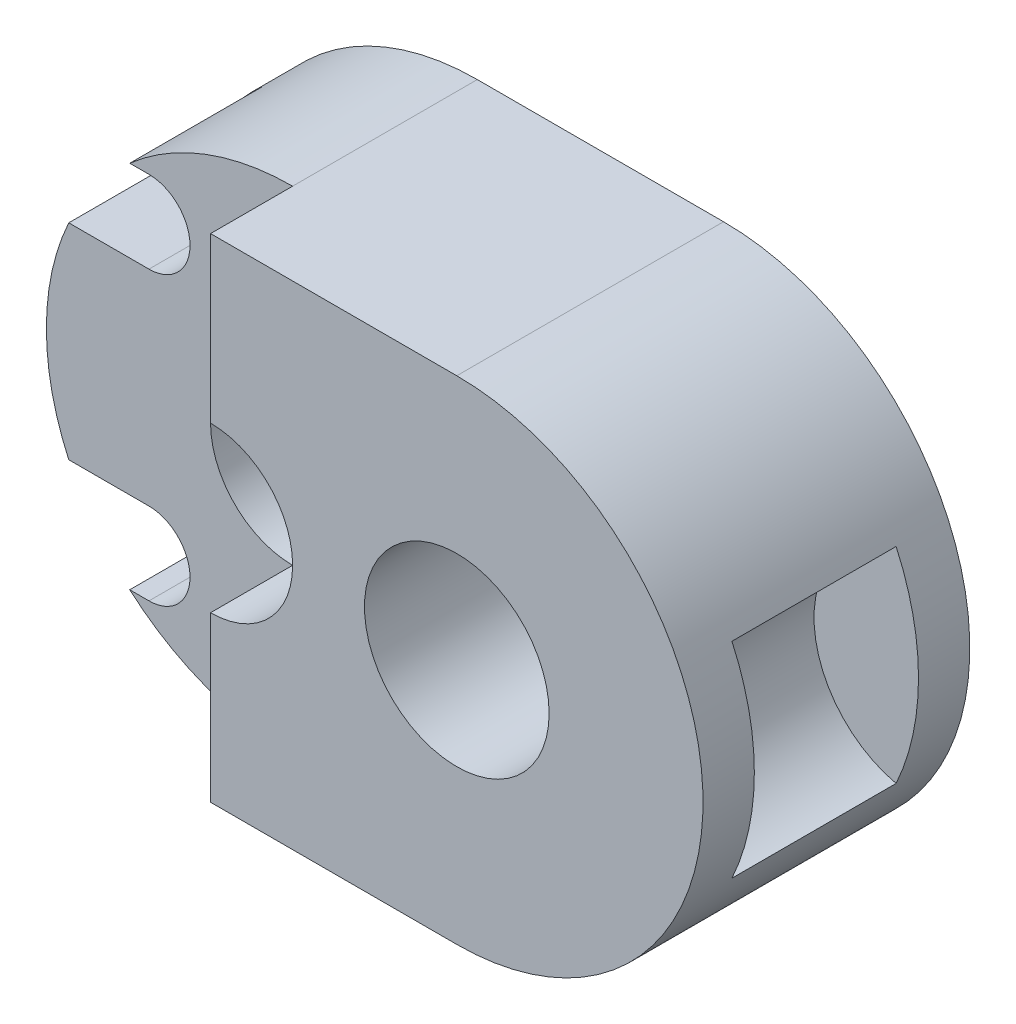
ISO-10303-21;
HEADER;
FILE_DESCRIPTION(('STEP AP214'),'2;1');
FILE_NAME('part.step','',(''),(''),'','','');
FILE_SCHEMA(('AUTOMOTIVE_DESIGN { 1 0 10303 214 1 1 1 1 }'));
ENDSEC;
DATA;
#1=APPLICATION_CONTEXT('core data for automotive mechanical design processes');
#2=APPLICATION_PROTOCOL_DEFINITION('international standard','automotive_design',2000,#1);
#3=PRODUCT_CONTEXT('',#1,'mechanical');
#4=PRODUCT('Part','Part','',(#3));
#5=PRODUCT_RELATED_PRODUCT_CATEGORY('part','',(#4));
#6=PRODUCT_DEFINITION_FORMATION('','',#4);
#7=PRODUCT_DEFINITION_CONTEXT('part definition',#1,'design');
#8=PRODUCT_DEFINITION('design','',#6,#7);
#9=PRODUCT_DEFINITION_SHAPE('','',#8);
#10=(LENGTH_UNIT() NAMED_UNIT(*) SI_UNIT(.MILLI.,.METRE.));
#11=(NAMED_UNIT(*) PLANE_ANGLE_UNIT() SI_UNIT($,.RADIAN.));
#12=(NAMED_UNIT(*) SI_UNIT($,.STERADIAN.) SOLID_ANGLE_UNIT());
#13=UNCERTAINTY_MEASURE_WITH_UNIT(LENGTH_MEASURE(1.E-05),#10,'distance_accuracy_value','');
#14=(GEOMETRIC_REPRESENTATION_CONTEXT(3) GLOBAL_UNCERTAINTY_ASSIGNED_CONTEXT((#13)) GLOBAL_UNIT_ASSIGNED_CONTEXT((#10,
#11,#12)) REPRESENTATION_CONTEXT('',''));
#15=CARTESIAN_POINT('',(0.,0.,0.));
#16=DIRECTION('',(0.,0.,1.));
#17=DIRECTION('',(1.,0.,0.));
#18=AXIS2_PLACEMENT_3D('',#15,#16,#17);
#19=CARTESIAN_POINT('',(-3.,0.,3.25));
#20=DIRECTION('',(0.,0.,-1.));
#21=DIRECTION('',(-1.,0.,0.));
#22=AXIS2_PLACEMENT_3D('',#19,#20,#21);
#23=CYLINDRICAL_SURFACE('',#22,0.5);
#24=CARTESIAN_POINT('',(-3.,0.,-3.25));
#25=DIRECTION('',(0.,0.,1.));
#26=DIRECTION('',(1.,0.,0.));
#27=AXIS2_PLACEMENT_3D('',#24,#25,#26);
#28=CIRCLE('',#27,0.5);
#29=CARTESIAN_POINT('',(-2.5,0.,-3.25));
#30=VERTEX_POINT('',#29);
#31=EDGE_CURVE('E290',#30,#30,#28,.T.);
#32=ORIENTED_EDGE('',*,*,#31,.F.);
#33=EDGE_LOOP('',(#32));
#34=FACE_BOUND('',#33,.T.);
#35=CARTESIAN_POINT('',(-3.,0.,-0.25));
#36=DIRECTION('',(0.,0.,1.));
#37=DIRECTION('',(1.,0.,0.));
#38=AXIS2_PLACEMENT_3D('',#35,#36,#37);
#39=CIRCLE('',#38,0.5);
#40=CARTESIAN_POINT('',(-2.5,0.,-0.25));
#41=VERTEX_POINT('',#40);
#42=EDGE_CURVE('E262',#41,#41,#39,.T.);
#43=ORIENTED_EDGE('',*,*,#42,.T.);
#44=EDGE_LOOP('',(#43));
#45=FACE_BOUND('',#44,.T.);
#46=ADVANCED_FACE('F68',(#34,#45),#23,.F.);
#47=CARTESIAN_POINT('',(-3.,0.,3.25));
#48=DIRECTION('',(0.,0.,1.));
#49=DIRECTION('',(1.,0.,0.));
#50=AXIS2_PLACEMENT_3D('',#47,#48,#49);
#51=PLANE('',#50);
#52=CARTESIAN_POINT('',(3.,0.,3.25));
#53=DIRECTION('',(0.,0.,1.));
#54=DIRECTION('',(1.,0.,0.));
#55=AXIS2_PLACEMENT_3D('',#52,#53,#54);
#56=CIRCLE('',#55,2.25);
#57=CARTESIAN_POINT('',(5.25,0.,3.25));
#58=VERTEX_POINT('',#57);
#59=EDGE_CURVE('E245',#58,#58,#56,.T.);
#60=ORIENTED_EDGE('',*,*,#59,.F.);
#61=EDGE_LOOP('',(#60));
#62=FACE_BOUND('',#61,.T.);
#63=CARTESIAN_POINT('',(-3.,0.,3.25));
#64=DIRECTION('',(0.,0.,1.));
#65=DIRECTION('',(1.,0.,0.));
#66=AXIS2_PLACEMENT_3D('',#63,#64,#65);
#67=CIRCLE('',#66,2.);
#68=CARTESIAN_POINT('',(-3.,-2.,3.25));
#69=VERTEX_POINT('',#68);
#70=CARTESIAN_POINT('',(-3.,2.,3.25));
#71=VERTEX_POINT('',#70);
#72=EDGE_CURVE('E249',#69,#71,#67,.T.);
#73=ORIENTED_EDGE('',*,*,#72,.F.);
#74=DIRECTION('',(0.,1.,0.));
#75=VECTOR('',#74,1.);
#76=CARTESIAN_POINT('',(-3.,6.,3.25));
#77=LINE('',#76,#75);
#78=CARTESIAN_POINT('',(-3.,-6.,3.25));
#79=VERTEX_POINT('',#78);
#80=EDGE_CURVE('E267',#79,#69,#77,.T.);
#81=ORIENTED_EDGE('',*,*,#80,.F.);
#82=DIRECTION('',(1.,0.,0.));
#83=VECTOR('',#82,1.);
#84=CARTESIAN_POINT('',(-3.,-6.,3.25));
#85=LINE('',#84,#83);
#86=CARTESIAN_POINT('',(3.,-6.,3.25));
#87=VERTEX_POINT('',#86);
#88=EDGE_CURVE('E296',#79,#87,#85,.T.);
#89=ORIENTED_EDGE('',*,*,#88,.T.);
#90=CARTESIAN_POINT('',(3.,0.,3.25));
#91=DIRECTION('',(0.,0.,1.));
#92=DIRECTION('',(1.,0.,0.));
#93=AXIS2_PLACEMENT_3D('',#90,#91,#92);
#94=CIRCLE('',#93,6.);
#95=CARTESIAN_POINT('',(3.,6.,3.25));
#96=VERTEX_POINT('',#95);
#97=EDGE_CURVE('E298',#87,#96,#94,.T.);
#98=ORIENTED_EDGE('',*,*,#97,.T.);
#99=DIRECTION('',(-1.,0.,0.));
#100=VECTOR('',#99,1.);
#101=CARTESIAN_POINT('',(-3.,6.,3.25));
#102=LINE('',#101,#100);
#103=CARTESIAN_POINT('',(-3.,6.,3.25));
#104=VERTEX_POINT('',#103);
#105=EDGE_CURVE('E301',#96,#104,#102,.T.);
#106=ORIENTED_EDGE('',*,*,#105,.T.);
#107=EDGE_CURVE('E268',#71,#104,#77,.T.);
#108=ORIENTED_EDGE('',*,*,#107,.F.);
#109=EDGE_LOOP('',(#73,#81,#89,#98,#106,#108));
#110=FACE_BOUND('',#109,.T.);
#111=ADVANCED_FACE('F389',(#62,#110),#51,.T.);
#112=CARTESIAN_POINT('',(-3.,0.,-3.25));
#113=DIRECTION('',(0.,0.,1.));
#114=DIRECTION('',(1.,0.,0.));
#115=AXIS2_PLACEMENT_3D('',#112,#113,#114);
#116=PLANE('',#115);
#117=CARTESIAN_POINT('',(3.,0.,-3.25));
#118=DIRECTION('',(0.,0.,1.));
#119=DIRECTION('',(1.,0.,0.));
#120=AXIS2_PLACEMENT_3D('',#117,#118,#119);
#121=CIRCLE('',#120,0.474999999999998);
#122=CARTESIAN_POINT('',(3.475,0.,-3.25));
#123=VERTEX_POINT('',#122);
#124=EDGE_CURVE('E366',#123,#123,#121,.T.);
#125=ORIENTED_EDGE('',*,*,#124,.T.);
#126=EDGE_LOOP('',(#125));
#127=FACE_BOUND('',#126,.T.);
#128=CARTESIAN_POINT('',(-6.5,3.5,-3.25));
#129=DIRECTION('',(0.,0.,1.));
#130=DIRECTION('',(1.,0.,0.));
#131=AXIS2_PLACEMENT_3D('',#128,#129,#130);
#132=CIRCLE('',#131,0.474999999999998);
#133=CARTESIAN_POINT('',(-6.025,3.5,-3.25));
#134=VERTEX_POINT('',#133);
#135=EDGE_CURVE('E360',#134,#134,#132,.T.);
#136=ORIENTED_EDGE('',*,*,#135,.T.);
#137=EDGE_LOOP('',(#136));
#138=FACE_BOUND('',#137,.T.);
#139=CARTESIAN_POINT('',(-6.5,-3.5,-3.25));
#140=DIRECTION('',(0.,0.,1.));
#141=DIRECTION('',(1.,0.,0.));
#142=AXIS2_PLACEMENT_3D('',#139,#140,#141);
#143=CIRCLE('',#142,0.474999999999998);
#144=CARTESIAN_POINT('',(-6.025,-3.5,-3.25));
#145=VERTEX_POINT('',#144);
#146=EDGE_CURVE('E72',#145,#145,#143,.T.);
#147=ORIENTED_EDGE('',*,*,#146,.T.);
#148=EDGE_LOOP('',(#147));
#149=FACE_BOUND('',#148,.T.);
#150=CARTESIAN_POINT('',(-3.,0.,-3.25));
#151=DIRECTION('',(0.,0.,1.));
#152=DIRECTION('',(1.,0.,0.));
#153=AXIS2_PLACEMENT_3D('',#150,#151,#152);
#154=CIRCLE('',#153,6.);
#155=CARTESIAN_POINT('',(-3.,6.,-3.25));
#156=VERTEX_POINT('',#155);
#157=CARTESIAN_POINT('',(-3.,-6.,-3.25));
#158=VERTEX_POINT('',#157);
#159=EDGE_CURVE('E295',#156,#158,#154,.T.);
#160=ORIENTED_EDGE('',*,*,#159,.F.);
#161=DIRECTION('',(-1.,0.,0.));
#162=VECTOR('',#161,1.);
#163=CARTESIAN_POINT('',(-3.,6.,-3.25));
#164=LINE('',#163,#162);
#165=CARTESIAN_POINT('',(3.,6.,-3.25));
#166=VERTEX_POINT('',#165);
#167=EDGE_CURVE('E299',#166,#156,#164,.T.);
#168=ORIENTED_EDGE('',*,*,#167,.F.);
#169=CARTESIAN_POINT('',(3.,0.,-3.25));
#170=DIRECTION('',(0.,0.,1.));
#171=DIRECTION('',(1.,0.,0.));
#172=AXIS2_PLACEMENT_3D('',#169,#170,#171);
#173=CIRCLE('',#172,6.);
#174=CARTESIAN_POINT('',(3.,-6.,-3.25));
#175=VERTEX_POINT('',#174);
#176=EDGE_CURVE('E309',#175,#166,#173,.T.);
#177=ORIENTED_EDGE('',*,*,#176,.F.);
#178=DIRECTION('',(1.,0.,0.));
#179=VECTOR('',#178,1.);
#180=CARTESIAN_POINT('',(-3.,-6.,-3.25));
#181=LINE('',#180,#179);
#182=EDGE_CURVE('E307',#158,#175,#181,.T.);
#183=ORIENTED_EDGE('',*,*,#182,.F.);
#184=EDGE_LOOP('',(#160,#168,#177,#183));
#185=FACE_BOUND('',#184,.T.);
#186=ORIENTED_EDGE('',*,*,#31,.T.);
#187=EDGE_LOOP('',(#186));
#188=FACE_BOUND('',#187,.T.);
#189=ADVANCED_FACE('F392',(#127,#138,#149,#185,#188),#116,.F.);
#190=CARTESIAN_POINT('',(-3.,0.,3.25));
#191=DIRECTION('',(0.,0.,-1.));
#192=DIRECTION('',(-1.,0.,0.));
#193=AXIS2_PLACEMENT_3D('',#190,#191,#192);
#194=CYLINDRICAL_SURFACE('',#193,6.);
#195=CARTESIAN_POINT('',(-3.,0.,-2.));
#196=DIRECTION('',(0.,0.,1.));
#197=DIRECTION('',(1.,0.,0.));
#198=AXIS2_PLACEMENT_3D('',#195,#196,#197);
#199=CIRCLE('',#198,6.);
#200=CARTESIAN_POINT('',(-6.96862696659689,4.5,-2.));
#201=VERTEX_POINT('',#200);
#202=CARTESIAN_POINT('',(-8.45435605731786,2.5,-2.));
#203=VERTEX_POINT('',#202);
#204=EDGE_CURVE('E12',#201,#203,#199,.T.);
#205=ORIENTED_EDGE('',*,*,#204,.F.);
#206=DIRECTION('',(0.,0.,-1.));
#207=VECTOR('',#206,1.);
#208=CARTESIAN_POINT('',(-6.96862696659689,4.5,3.25));
#209=LINE('',#208,#207);
#210=CARTESIAN_POINT('',(-6.96862696659689,4.5,1.25));
#211=VERTEX_POINT('',#210);
#212=EDGE_CURVE('E242',#201,#211,#209,.F.);
#213=ORIENTED_EDGE('',*,*,#212,.T.);
#214=CARTESIAN_POINT('',(-3.,0.,1.25));
#215=DIRECTION('',(0.,0.,-1.));
#216=DIRECTION('',(-1.,0.,0.));
#217=AXIS2_PLACEMENT_3D('',#214,#215,#216);
#218=CIRCLE('',#217,6.);
#219=CARTESIAN_POINT('',(-3.,6.,1.25));
#220=VERTEX_POINT('',#219);
#221=EDGE_CURVE('E275',#211,#220,#218,.T.);
#222=ORIENTED_EDGE('',*,*,#221,.T.);
#223=DIRECTION('',(0.,0.,-1.));
#224=VECTOR('',#223,1.);
#225=CARTESIAN_POINT('',(-3.,6.,3.25));
#226=LINE('',#225,#224);
#227=EDGE_CURVE('E304',#220,#156,#226,.T.);
#228=ORIENTED_EDGE('',*,*,#227,.T.);
#229=ORIENTED_EDGE('',*,*,#159,.T.);
#230=DIRECTION('',(0.,0.,-1.));
#231=VECTOR('',#230,1.);
#232=CARTESIAN_POINT('',(-3.,-6.,3.25));
#233=LINE('',#232,#231);
#234=CARTESIAN_POINT('',(-3.,-6.,1.25));
#235=VERTEX_POINT('',#234);
#236=EDGE_CURVE('E322',#235,#158,#233,.T.);
#237=ORIENTED_EDGE('',*,*,#236,.F.);
#238=CARTESIAN_POINT('',(-6.96862696659688,-4.5,1.25));
#239=VERTEX_POINT('',#238);
#240=EDGE_CURVE('E270',#235,#239,#218,.T.);
#241=ORIENTED_EDGE('',*,*,#240,.T.);
#242=DIRECTION('',(0.,0.,-1.));
#243=VECTOR('',#242,1.);
#244=CARTESIAN_POINT('',(-6.96862696659689,-4.5,3.25));
#245=LINE('',#244,#243);
#246=CARTESIAN_POINT('',(-6.96862696659688,-4.5,-2.));
#247=VERTEX_POINT('',#246);
#248=EDGE_CURVE('E217',#247,#239,#245,.F.);
#249=ORIENTED_EDGE('',*,*,#248,.F.);
#250=CARTESIAN_POINT('',(-3.,0.,-2.));
#251=DIRECTION('',(0.,0.,1.));
#252=DIRECTION('',(1.,0.,0.));
#253=AXIS2_PLACEMENT_3D('',#250,#251,#252);
#254=CIRCLE('',#253,6.);
#255=CARTESIAN_POINT('',(-8.45435605731786,-2.5,-2.));
#256=VERTEX_POINT('',#255);
#257=EDGE_CURVE('E77',#256,#247,#254,.T.);
#258=ORIENTED_EDGE('',*,*,#257,.F.);
#259=DIRECTION('',(0.,0.,-1.));
#260=VECTOR('',#259,1.);
#261=CARTESIAN_POINT('',(-8.45435605731786,-2.5,3.25));
#262=LINE('',#261,#260);
#263=CARTESIAN_POINT('',(-8.45435605731786,-2.5,1.25));
#264=VERTEX_POINT('',#263);
#265=EDGE_CURVE('E238',#256,#264,#262,.F.);
#266=ORIENTED_EDGE('',*,*,#265,.T.);
#267=CARTESIAN_POINT('',(-8.45435605731786,2.5,1.25));
#268=VERTEX_POINT('',#267);
#269=EDGE_CURVE('E274',#264,#268,#218,.T.);
#270=ORIENTED_EDGE('',*,*,#269,.T.);
#271=DIRECTION('',(0.,0.,-1.));
#272=VECTOR('',#271,1.);
#273=CARTESIAN_POINT('',(-8.45435605731786,2.5,3.25));
#274=LINE('',#273,#272);
#275=EDGE_CURVE('E92',#203,#268,#274,.F.);
#276=ORIENTED_EDGE('',*,*,#275,.F.);
#277=EDGE_LOOP('',(#205,#213,#222,#228,#229,#237,#241,#249,#258,#266,#270,#276));
#278=FACE_BOUND('',#277,.T.);
#279=ADVANCED_FACE('F70',(#278),#194,.T.);
#280=CARTESIAN_POINT('',(-3.,-6.,3.25));
#281=DIRECTION('',(0.,1.,0.));
#282=DIRECTION('',(-1.,0.,0.));
#283=AXIS2_PLACEMENT_3D('',#280,#281,#282);
#284=PLANE('',#283);
#285=ORIENTED_EDGE('',*,*,#182,.T.);
#286=DIRECTION('',(0.,0.,-1.));
#287=VECTOR('',#286,1.);
#288=CARTESIAN_POINT('',(3.,-6.,3.25));
#289=LINE('',#288,#287);
#290=EDGE_CURVE('E319',#87,#175,#289,.T.);
#291=ORIENTED_EDGE('',*,*,#290,.F.);
#292=ORIENTED_EDGE('',*,*,#88,.F.);
#293=EDGE_CURVE('E323',#79,#235,#233,.T.);
#294=ORIENTED_EDGE('',*,*,#293,.T.);
#295=ORIENTED_EDGE('',*,*,#236,.T.);
#296=EDGE_LOOP('',(#285,#291,#292,#294,#295));
#297=FACE_BOUND('',#296,.T.);
#298=ADVANCED_FACE('F415',(#297),#284,.F.);
#299=CARTESIAN_POINT('',(3.,0.,3.25));
#300=DIRECTION('',(0.,0.,-1.));
#301=DIRECTION('',(-1.,0.,0.));
#302=AXIS2_PLACEMENT_3D('',#299,#300,#301);
#303=CYLINDRICAL_SURFACE('',#302,6.);
#304=DIRECTION('',(0.,0.,1.));
#305=VECTOR('',#304,1.);
#306=CARTESIAN_POINT('',(8.45435605731786,2.5,-2.));
#307=LINE('',#306,#305);
#308=CARTESIAN_POINT('',(8.45435605731786,2.5,-2.));
#309=VERTEX_POINT('',#308);
#310=CARTESIAN_POINT('',(8.45435605731786,2.5,2.));
#311=VERTEX_POINT('',#310);
#312=EDGE_CURVE('E282',#309,#311,#307,.T.);
#313=ORIENTED_EDGE('',*,*,#312,.F.);
#314=CARTESIAN_POINT('',(3.,0.,-2.));
#315=DIRECTION('',(0.,0.,1.));
#316=DIRECTION('',(-1.,0.,0.));
#317=AXIS2_PLACEMENT_3D('',#314,#315,#316);
#318=CIRCLE('',#317,6.);
#319=CARTESIAN_POINT('',(8.45435605731785,-2.5,-2.));
#320=VERTEX_POINT('',#319);
#321=EDGE_CURVE('E276',#320,#309,#318,.T.);
#322=ORIENTED_EDGE('',*,*,#321,.F.);
#323=DIRECTION('',(0.,0.,1.));
#324=VECTOR('',#323,1.);
#325=CARTESIAN_POINT('',(8.45435605731785,-2.5,-2.));
#326=LINE('',#325,#324);
#327=CARTESIAN_POINT('',(8.45435605731785,-2.5,2.));
#328=VERTEX_POINT('',#327);
#329=EDGE_CURVE('E287',#320,#328,#326,.T.);
#330=ORIENTED_EDGE('',*,*,#329,.T.);
#331=CARTESIAN_POINT('',(3.,0.,2.));
#332=DIRECTION('',(0.,0.,1.));
#333=DIRECTION('',(-1.,0.,0.));
#334=AXIS2_PLACEMENT_3D('',#331,#332,#333);
#335=CIRCLE('',#334,6.);
#336=EDGE_CURVE('E273',#328,#311,#335,.T.);
#337=ORIENTED_EDGE('',*,*,#336,.T.);
#338=EDGE_LOOP('',(#313,#322,#330,#337));
#339=FACE_BOUND('',#338,.T.);
#340=ORIENTED_EDGE('',*,*,#176,.T.);
#341=DIRECTION('',(0.,0.,-1.));
#342=VECTOR('',#341,1.);
#343=CARTESIAN_POINT('',(3.,6.,3.25));
#344=LINE('',#343,#342);
#345=EDGE_CURVE('E316',#96,#166,#344,.T.);
#346=ORIENTED_EDGE('',*,*,#345,.F.);
#347=ORIENTED_EDGE('',*,*,#97,.F.);
#348=ORIENTED_EDGE('',*,*,#290,.T.);
#349=EDGE_LOOP('',(#340,#346,#347,#348));
#350=FACE_BOUND('',#349,.T.);
#351=ADVANCED_FACE('F418',(#339,#350),#303,.T.);
#352=CARTESIAN_POINT('',(-3.,6.,3.25));
#353=DIRECTION('',(0.,-1.,0.));
#354=DIRECTION('',(1.,0.,0.));
#355=AXIS2_PLACEMENT_3D('',#352,#353,#354);
#356=PLANE('',#355);
#357=ORIENTED_EDGE('',*,*,#167,.T.);
#358=ORIENTED_EDGE('',*,*,#227,.F.);
#359=EDGE_CURVE('E313',#104,#220,#226,.T.);
#360=ORIENTED_EDGE('',*,*,#359,.F.);
#361=ORIENTED_EDGE('',*,*,#105,.F.);
#362=ORIENTED_EDGE('',*,*,#345,.T.);
#363=EDGE_LOOP('',(#357,#358,#360,#361,#362));
#364=FACE_BOUND('',#363,.T.);
#365=ADVANCED_FACE('F406',(#364),#356,.F.);
#366=CARTESIAN_POINT('',(9.01685605731786,0.,-2.));
#367=DIRECTION('',(0.,0.,1.));
#368=DIRECTION('',(1.,0.,0.));
#369=AXIS2_PLACEMENT_3D('',#366,#367,#368);
#370=CYLINDRICAL_SURFACE('',#369,2.5625);
#371=CARTESIAN_POINT('',(9.01685605731786,0.,2.));
#372=DIRECTION('',(0.,0.,1.));
#373=DIRECTION('',(1.,0.,0.));
#374=AXIS2_PLACEMENT_3D('',#371,#372,#373);
#375=CIRCLE('',#374,2.5625);
#376=EDGE_CURVE('E279',#311,#328,#375,.T.);
#377=ORIENTED_EDGE('',*,*,#376,.T.);
#378=ORIENTED_EDGE('',*,*,#329,.F.);
#379=CARTESIAN_POINT('',(9.01685605731786,0.,-2.));
#380=DIRECTION('',(0.,0.,1.));
#381=DIRECTION('',(1.,0.,0.));
#382=AXIS2_PLACEMENT_3D('',#379,#380,#381);
#383=CIRCLE('',#382,2.5625);
#384=EDGE_CURVE('E278',#309,#320,#383,.T.);
#385=ORIENTED_EDGE('',*,*,#384,.F.);
#386=ORIENTED_EDGE('',*,*,#312,.T.);
#387=EDGE_LOOP('',(#377,#378,#385,#386));
#388=FACE_BOUND('',#387,.T.);
#389=ADVANCED_FACE('F427',(#388),#370,.F.);
#390=CARTESIAN_POINT('',(6.00842802865893,0.,-2.));
#391=DIRECTION('',(0.,0.,-1.));
#392=DIRECTION('',(-1.,0.,0.));
#393=AXIS2_PLACEMENT_3D('',#390,#391,#392);
#394=PLANE('',#393);
#395=ORIENTED_EDGE('',*,*,#321,.T.);
#396=ORIENTED_EDGE('',*,*,#384,.T.);
#397=EDGE_LOOP('',(#395,#396));
#398=FACE_BOUND('',#397,.T.);
#399=ADVANCED_FACE('F500',(#398),#394,.F.);
#400=CARTESIAN_POINT('',(6.00842802865893,0.,2.));
#401=DIRECTION('',(0.,0.,-1.));
#402=DIRECTION('',(-1.,0.,0.));
#403=AXIS2_PLACEMENT_3D('',#400,#401,#402);
#404=PLANE('',#403);
#405=ORIENTED_EDGE('',*,*,#336,.F.);
#406=ORIENTED_EDGE('',*,*,#376,.F.);
#407=EDGE_LOOP('',(#405,#406));
#408=FACE_BOUND('',#407,.T.);
#409=ADVANCED_FACE('F502',(#408),#404,.T.);
#410=CARTESIAN_POINT('',(-3.,6.,1.25));
#411=DIRECTION('',(1.,0.,0.));
#412=DIRECTION('',(0.,0.,-1.));
#413=AXIS2_PLACEMENT_3D('',#410,#411,#412);
#414=PLANE('',#413);
#415=ORIENTED_EDGE('',*,*,#80,.T.);
#416=DIRECTION('',(0.,0.,1.));
#417=VECTOR('',#416,1.);
#418=CARTESIAN_POINT('',(-3.,-2.,-0.25));
#419=LINE('',#418,#417);
#420=CARTESIAN_POINT('',(-3.,-2.,1.25));
#421=VERTEX_POINT('',#420);
#422=EDGE_CURVE('E259',#69,#421,#419,.F.);
#423=ORIENTED_EDGE('',*,*,#422,.T.);
#424=DIRECTION('',(0.,1.,0.));
#425=VECTOR('',#424,1.);
#426=CARTESIAN_POINT('',(-3.,6.,1.25));
#427=LINE('',#426,#425);
#428=EDGE_CURVE('E266',#235,#421,#427,.T.);
#429=ORIENTED_EDGE('',*,*,#428,.F.);
#430=ORIENTED_EDGE('',*,*,#293,.F.);
#431=EDGE_LOOP('',(#415,#423,#429,#430));
#432=FACE_BOUND('',#431,.T.);
#433=ADVANCED_FACE('F348',(#432),#414,.F.);
#434=CARTESIAN_POINT('',(0.,0.,1.25));
#435=DIRECTION('',(0.,0.,-1.));
#436=DIRECTION('',(-1.,0.,0.));
#437=AXIS2_PLACEMENT_3D('',#434,#435,#436);
#438=PLANE('',#437);
#439=ORIENTED_EDGE('',*,*,#221,.F.);
#440=DIRECTION('',(-1.,0.,0.));
#441=VECTOR('',#440,1.);
#442=CARTESIAN_POINT('',(0.,4.5,1.25));
#443=LINE('',#442,#441);
#444=CARTESIAN_POINT('',(-6.5,4.5,1.25));
#445=VERTEX_POINT('',#444);
#446=EDGE_CURVE('E211',#445,#211,#443,.T.);
#447=ORIENTED_EDGE('',*,*,#446,.F.);
#448=CARTESIAN_POINT('',(-6.5,3.5,1.25));
#449=DIRECTION('',(0.,0.,1.));
#450=DIRECTION('',(1.,0.,0.));
#451=AXIS2_PLACEMENT_3D('',#448,#449,#450);
#452=CIRCLE('',#451,1.);
#453=CARTESIAN_POINT('',(-6.5,2.5,1.25));
#454=VERTEX_POINT('',#453);
#455=EDGE_CURVE('E215',#454,#445,#452,.T.);
#456=ORIENTED_EDGE('',*,*,#455,.F.);
#457=DIRECTION('',(-1.,0.,0.));
#458=VECTOR('',#457,1.);
#459=CARTESIAN_POINT('',(0.,2.5,1.25));
#460=LINE('',#459,#458);
#461=EDGE_CURVE('E191',#454,#268,#460,.T.);
#462=ORIENTED_EDGE('',*,*,#461,.T.);
#463=ORIENTED_EDGE('',*,*,#269,.F.);
#464=DIRECTION('',(-1.,0.,0.));
#465=VECTOR('',#464,1.);
#466=CARTESIAN_POINT('',(0.,-2.5,1.25));
#467=LINE('',#466,#465);
#468=CARTESIAN_POINT('',(-6.5,-2.5,1.25));
#469=VERTEX_POINT('',#468);
#470=EDGE_CURVE('E229',#469,#264,#467,.T.);
#471=ORIENTED_EDGE('',*,*,#470,.F.);
#472=CARTESIAN_POINT('',(-6.5,-3.5,1.25));
#473=DIRECTION('',(0.,0.,1.));
#474=DIRECTION('',(1.,0.,0.));
#475=AXIS2_PLACEMENT_3D('',#472,#473,#474);
#476=CIRCLE('',#475,1.);
#477=CARTESIAN_POINT('',(-6.5,-4.5,1.25));
#478=VERTEX_POINT('',#477);
#479=EDGE_CURVE('E213',#478,#469,#476,.T.);
#480=ORIENTED_EDGE('',*,*,#479,.F.);
#481=DIRECTION('',(-1.,0.,0.));
#482=VECTOR('',#481,1.);
#483=CARTESIAN_POINT('',(0.,-4.5,1.25));
#484=LINE('',#483,#482);
#485=EDGE_CURVE('E84',#478,#239,#484,.T.);
#486=ORIENTED_EDGE('',*,*,#485,.T.);
#487=ORIENTED_EDGE('',*,*,#240,.F.);
#488=ORIENTED_EDGE('',*,*,#428,.T.);
#489=CARTESIAN_POINT('',(-3.,0.,1.25));
#490=DIRECTION('',(0.,0.,-1.));
#491=DIRECTION('',(-1.,0.,0.));
#492=AXIS2_PLACEMENT_3D('',#489,#490,#491);
#493=CIRCLE('',#492,2.);
#494=CARTESIAN_POINT('',(-3.,2.,1.25));
#495=VERTEX_POINT('',#494);
#496=EDGE_CURVE('E255',#421,#495,#493,.T.);
#497=ORIENTED_EDGE('',*,*,#496,.T.);
#498=EDGE_CURVE('E263',#495,#220,#427,.T.);
#499=ORIENTED_EDGE('',*,*,#498,.T.);
#500=EDGE_LOOP('',(#439,#447,#456,#462,#463,#471,#480,#486,#487,#488,#497,#499));
#501=FACE_BOUND('',#500,.T.);
#502=ADVANCED_FACE('F344',(#501),#438,.F.);
#503=ORIENTED_EDGE('',*,*,#498,.F.);
#504=DIRECTION('',(0.,0.,1.));
#505=VECTOR('',#504,1.);
#506=CARTESIAN_POINT('',(-3.,2.,-0.25));
#507=LINE('',#506,#505);
#508=EDGE_CURVE('E326',#495,#71,#507,.T.);
#509=ORIENTED_EDGE('',*,*,#508,.T.);
#510=ORIENTED_EDGE('',*,*,#107,.T.);
#511=ORIENTED_EDGE('',*,*,#359,.T.);
#512=EDGE_LOOP('',(#503,#509,#510,#511));
#513=FACE_BOUND('',#512,.T.);
#514=ADVANCED_FACE('F401',(#513),#414,.F.);
#515=CARTESIAN_POINT('',(-3.,0.,-0.25));
#516=DIRECTION('',(0.,0.,1.));
#517=DIRECTION('',(1.,0.,0.));
#518=AXIS2_PLACEMENT_3D('',#515,#516,#517);
#519=CYLINDRICAL_SURFACE('',#518,2.);
#520=CARTESIAN_POINT('',(-3.,0.,-0.25));
#521=DIRECTION('',(0.,0.,1.));
#522=DIRECTION('',(1.,0.,0.));
#523=AXIS2_PLACEMENT_3D('',#520,#521,#522);
#524=CIRCLE('',#523,2.);
#525=CARTESIAN_POINT('',(-1.,0.,-0.25));
#526=VERTEX_POINT('',#525);
#527=EDGE_CURVE('E252',#526,#526,#524,.T.);
#528=ORIENTED_EDGE('',*,*,#527,.F.);
#529=EDGE_LOOP('',(#528));
#530=FACE_BOUND('',#529,.T.);
#531=ORIENTED_EDGE('',*,*,#72,.T.);
#532=ORIENTED_EDGE('',*,*,#508,.F.);
#533=ORIENTED_EDGE('',*,*,#496,.F.);
#534=ORIENTED_EDGE('',*,*,#422,.F.);
#535=EDGE_LOOP('',(#531,#532,#533,#534));
#536=FACE_BOUND('',#535,.T.);
#537=ADVANCED_FACE('F398',(#530,#536),#519,.F.);
#538=CARTESIAN_POINT('',(-3.,0.,-0.25));
#539=DIRECTION('',(0.,0.,1.));
#540=DIRECTION('',(1.,0.,0.));
#541=AXIS2_PLACEMENT_3D('',#538,#539,#540);
#542=PLANE('',#541);
#543=ORIENTED_EDGE('',*,*,#42,.F.);
#544=EDGE_LOOP('',(#543));
#545=FACE_BOUND('',#544,.T.);
#546=ORIENTED_EDGE('',*,*,#527,.T.);
#547=EDGE_LOOP('',(#546));
#548=FACE_BOUND('',#547,.T.);
#549=ADVANCED_FACE('F385',(#545,#548),#542,.T.);
#550=CARTESIAN_POINT('',(3.,0.,-0.25));
#551=DIRECTION('',(0.,0.,1.));
#552=DIRECTION('',(1.,0.,0.));
#553=AXIS2_PLACEMENT_3D('',#550,#551,#552);
#554=CYLINDRICAL_SURFACE('',#553,2.25);
#555=CARTESIAN_POINT('',(3.,0.,-0.25));
#556=DIRECTION('',(0.,0.,1.));
#557=DIRECTION('',(1.,0.,0.));
#558=AXIS2_PLACEMENT_3D('',#555,#556,#557);
#559=CIRCLE('',#558,2.25);
#560=CARTESIAN_POINT('',(5.25,0.,-0.25));
#561=VERTEX_POINT('',#560);
#562=EDGE_CURVE('E246',#561,#561,#559,.T.);
#563=ORIENTED_EDGE('',*,*,#562,.F.);
#564=EDGE_LOOP('',(#563));
#565=FACE_BOUND('',#564,.T.);
#566=ORIENTED_EDGE('',*,*,#59,.T.);
#567=EDGE_LOOP('',(#566));
#568=FACE_BOUND('',#567,.T.);
#569=ADVANCED_FACE('F379',(#565,#568),#554,.F.);
#570=CARTESIAN_POINT('',(3.,0.,-0.25));
#571=DIRECTION('',(0.,0.,1.));
#572=DIRECTION('',(1.,0.,0.));
#573=AXIS2_PLACEMENT_3D('',#570,#571,#572);
#574=PLANE('',#573);
#575=CARTESIAN_POINT('',(3.,0.,-0.25));
#576=DIRECTION('',(0.,0.,1.));
#577=DIRECTION('',(1.,0.,0.));
#578=AXIS2_PLACEMENT_3D('',#575,#576,#577);
#579=CIRCLE('',#578,0.474999999999998);
#580=CARTESIAN_POINT('',(3.475,0.,-0.25));
#581=VERTEX_POINT('',#580);
#582=EDGE_CURVE('E369',#581,#581,#579,.T.);
#583=ORIENTED_EDGE('',*,*,#582,.F.);
#584=EDGE_LOOP('',(#583));
#585=FACE_BOUND('',#584,.T.);
#586=ORIENTED_EDGE('',*,*,#562,.T.);
#587=EDGE_LOOP('',(#586));
#588=FACE_BOUND('',#587,.T.);
#589=ADVANCED_FACE('F376',(#585,#588),#574,.T.);
#590=CARTESIAN_POINT('',(0.,0.,-2.));
#591=DIRECTION('',(0.,0.,1.));
#592=DIRECTION('',(1.,0.,0.));
#593=AXIS2_PLACEMENT_3D('',#590,#591,#592);
#594=PLANE('',#593);
#595=CARTESIAN_POINT('',(-6.5,-3.5,-2.));
#596=DIRECTION('',(0.,0.,1.));
#597=DIRECTION('',(1.,0.,0.));
#598=AXIS2_PLACEMENT_3D('',#595,#596,#597);
#599=CIRCLE('',#598,0.474999999999998);
#600=CARTESIAN_POINT('',(-6.025,-3.5,-2.));
#601=VERTEX_POINT('',#600);
#602=EDGE_CURVE('E357',#601,#601,#599,.T.);
#603=ORIENTED_EDGE('',*,*,#602,.F.);
#604=EDGE_LOOP('',(#603));
#605=FACE_BOUND('',#604,.T.);
#606=ORIENTED_EDGE('',*,*,#257,.T.);
#607=DIRECTION('',(-1.,0.,0.));
#608=VECTOR('',#607,1.);
#609=CARTESIAN_POINT('',(0.,-4.5,-2.));
#610=LINE('',#609,#608);
#611=CARTESIAN_POINT('',(-6.5,-4.5,-2.));
#612=VERTEX_POINT('',#611);
#613=EDGE_CURVE('E231',#612,#247,#610,.T.);
#614=ORIENTED_EDGE('',*,*,#613,.F.);
#615=CARTESIAN_POINT('',(-6.5,-3.5,-2.));
#616=DIRECTION('',(0.,0.,1.));
#617=DIRECTION('',(1.,0.,0.));
#618=AXIS2_PLACEMENT_3D('',#615,#616,#617);
#619=CIRCLE('',#618,1.);
#620=CARTESIAN_POINT('',(-6.5,-2.5,-2.));
#621=VERTEX_POINT('',#620);
#622=EDGE_CURVE('E221',#612,#621,#619,.T.);
#623=ORIENTED_EDGE('',*,*,#622,.T.);
#624=DIRECTION('',(-1.,0.,0.));
#625=VECTOR('',#624,1.);
#626=CARTESIAN_POINT('',(0.,-2.5,-2.));
#627=LINE('',#626,#625);
#628=EDGE_CURVE('E226',#621,#256,#627,.T.);
#629=ORIENTED_EDGE('',*,*,#628,.T.);
#630=EDGE_LOOP('',(#606,#614,#623,#629));
#631=FACE_BOUND('',#630,.T.);
#632=ADVANCED_FACE('F334',(#605,#631),#594,.T.);
#633=CARTESIAN_POINT('',(0.,-2.5,-2.));
#634=DIRECTION('',(0.,1.,0.));
#635=DIRECTION('',(0.,0.,1.));
#636=AXIS2_PLACEMENT_3D('',#633,#634,#635);
#637=PLANE('',#636);
#638=ORIENTED_EDGE('',*,*,#628,.F.);
#639=DIRECTION('',(0.,0.,1.));
#640=VECTOR('',#639,1.);
#641=CARTESIAN_POINT('',(-6.5,-2.5,-2.));
#642=LINE('',#641,#640);
#643=EDGE_CURVE('E227',#621,#469,#642,.T.);
#644=ORIENTED_EDGE('',*,*,#643,.T.);
#645=ORIENTED_EDGE('',*,*,#470,.T.);
#646=ORIENTED_EDGE('',*,*,#265,.F.);
#647=EDGE_LOOP('',(#638,#644,#645,#646));
#648=FACE_BOUND('',#647,.T.);
#649=ADVANCED_FACE('F480',(#648),#637,.F.);
#650=CARTESIAN_POINT('',(0.,-4.5,-2.));
#651=DIRECTION('',(0.,1.,0.));
#652=DIRECTION('',(-1.,0.,0.));
#653=AXIS2_PLACEMENT_3D('',#650,#651,#652);
#654=PLANE('',#653);
#655=ORIENTED_EDGE('',*,*,#248,.T.);
#656=ORIENTED_EDGE('',*,*,#485,.F.);
#657=DIRECTION('',(0.,0.,1.));
#658=VECTOR('',#657,1.);
#659=CARTESIAN_POINT('',(-6.5,-4.5,-2.));
#660=LINE('',#659,#658);
#661=EDGE_CURVE('E224',#612,#478,#660,.T.);
#662=ORIENTED_EDGE('',*,*,#661,.F.);
#663=ORIENTED_EDGE('',*,*,#613,.T.);
#664=EDGE_LOOP('',(#655,#656,#662,#663));
#665=FACE_BOUND('',#664,.T.);
#666=ADVANCED_FACE('F338',(#665),#654,.T.);
#667=CARTESIAN_POINT('',(-6.5,-3.5,-2.));
#668=DIRECTION('',(0.,0.,1.));
#669=DIRECTION('',(1.,0.,0.));
#670=AXIS2_PLACEMENT_3D('',#667,#668,#669);
#671=CYLINDRICAL_SURFACE('',#670,1.);
#672=ORIENTED_EDGE('',*,*,#479,.T.);
#673=ORIENTED_EDGE('',*,*,#643,.F.);
#674=ORIENTED_EDGE('',*,*,#622,.F.);
#675=ORIENTED_EDGE('',*,*,#661,.T.);
#676=EDGE_LOOP('',(#672,#673,#674,#675));
#677=FACE_BOUND('',#676,.T.);
#678=ADVANCED_FACE('F471',(#677),#671,.F.);
#679=CARTESIAN_POINT('',(0.,0.,-2.));
#680=DIRECTION('',(0.,0.,1.));
#681=DIRECTION('',(1.,0.,0.));
#682=AXIS2_PLACEMENT_3D('',#679,#680,#681);
#683=PLANE('',#682);
#684=CARTESIAN_POINT('',(-6.5,3.5,-2.));
#685=DIRECTION('',(0.,0.,1.));
#686=DIRECTION('',(1.,0.,0.));
#687=AXIS2_PLACEMENT_3D('',#684,#685,#686);
#688=CIRCLE('',#687,0.474999999999998);
#689=CARTESIAN_POINT('',(-6.025,3.5,-2.));
#690=VERTEX_POINT('',#689);
#691=EDGE_CURVE('E363',#690,#690,#688,.T.);
#692=ORIENTED_EDGE('',*,*,#691,.F.);
#693=EDGE_LOOP('',(#692));
#694=FACE_BOUND('',#693,.T.);
#695=ORIENTED_EDGE('',*,*,#204,.T.);
#696=DIRECTION('',(-1.,0.,0.));
#697=VECTOR('',#696,1.);
#698=CARTESIAN_POINT('',(0.,2.5,-2.));
#699=LINE('',#698,#697);
#700=CARTESIAN_POINT('',(-6.5,2.5,-2.));
#701=VERTEX_POINT('',#700);
#702=EDGE_CURVE('E190',#701,#203,#699,.T.);
#703=ORIENTED_EDGE('',*,*,#702,.F.);
#704=CARTESIAN_POINT('',(-6.5,3.5,-2.));
#705=DIRECTION('',(0.,0.,1.));
#706=DIRECTION('',(1.,0.,0.));
#707=AXIS2_PLACEMENT_3D('',#704,#705,#706);
#708=CIRCLE('',#707,1.);
#709=CARTESIAN_POINT('',(-6.5,4.5,-2.));
#710=VERTEX_POINT('',#709);
#711=EDGE_CURVE('E197',#701,#710,#708,.T.);
#712=ORIENTED_EDGE('',*,*,#711,.T.);
#713=DIRECTION('',(-1.,0.,0.));
#714=VECTOR('',#713,1.);
#715=CARTESIAN_POINT('',(0.,4.5,-2.));
#716=LINE('',#715,#714);
#717=EDGE_CURVE('E204',#710,#201,#716,.T.);
#718=ORIENTED_EDGE('',*,*,#717,.T.);
#719=EDGE_LOOP('',(#695,#703,#712,#718));
#720=FACE_BOUND('',#719,.T.);
#721=ADVANCED_FACE('F201',(#694,#720),#683,.T.);
#722=CARTESIAN_POINT('',(0.,4.5,-2.));
#723=DIRECTION('',(0.,1.,0.));
#724=DIRECTION('',(0.,0.,1.));
#725=AXIS2_PLACEMENT_3D('',#722,#723,#724);
#726=PLANE('',#725);
#727=ORIENTED_EDGE('',*,*,#717,.F.);
#728=DIRECTION('',(0.,0.,1.));
#729=VECTOR('',#728,1.);
#730=CARTESIAN_POINT('',(-6.5,4.5,-2.));
#731=LINE('',#730,#729);
#732=EDGE_CURVE('E196',#710,#445,#731,.T.);
#733=ORIENTED_EDGE('',*,*,#732,.T.);
#734=ORIENTED_EDGE('',*,*,#446,.T.);
#735=ORIENTED_EDGE('',*,*,#212,.F.);
#736=EDGE_LOOP('',(#727,#733,#734,#735));
#737=FACE_BOUND('',#736,.T.);
#738=ADVANCED_FACE('F355',(#737),#726,.F.);
#739=CARTESIAN_POINT('',(0.,2.5,-2.));
#740=DIRECTION('',(0.,1.,0.));
#741=DIRECTION('',(-1.,0.,0.));
#742=AXIS2_PLACEMENT_3D('',#739,#740,#741);
#743=PLANE('',#742);
#744=ORIENTED_EDGE('',*,*,#275,.T.);
#745=ORIENTED_EDGE('',*,*,#461,.F.);
#746=DIRECTION('',(0.,0.,1.));
#747=VECTOR('',#746,1.);
#748=CARTESIAN_POINT('',(-6.5,2.5,-2.));
#749=LINE('',#748,#747);
#750=EDGE_CURVE('E187',#701,#454,#749,.T.);
#751=ORIENTED_EDGE('',*,*,#750,.F.);
#752=ORIENTED_EDGE('',*,*,#702,.T.);
#753=EDGE_LOOP('',(#744,#745,#751,#752));
#754=FACE_BOUND('',#753,.T.);
#755=ADVANCED_FACE('F189',(#754),#743,.T.);
#756=CARTESIAN_POINT('',(-6.5,3.5,-2.));
#757=DIRECTION('',(0.,0.,1.));
#758=DIRECTION('',(1.,0.,0.));
#759=AXIS2_PLACEMENT_3D('',#756,#757,#758);
#760=CYLINDRICAL_SURFACE('',#759,1.);
#761=ORIENTED_EDGE('',*,*,#455,.T.);
#762=ORIENTED_EDGE('',*,*,#732,.F.);
#763=ORIENTED_EDGE('',*,*,#711,.F.);
#764=ORIENTED_EDGE('',*,*,#750,.T.);
#765=EDGE_LOOP('',(#761,#762,#763,#764));
#766=FACE_BOUND('',#765,.T.);
#767=ADVANCED_FACE('F206',(#766),#760,.F.);
#768=CARTESIAN_POINT('',(-6.5,-3.5,-2.));
#769=DIRECTION('',(0.,0.,1.));
#770=DIRECTION('',(1.,0.,0.));
#771=AXIS2_PLACEMENT_3D('',#768,#769,#770);
#772=CYLINDRICAL_SURFACE('',#771,0.474999999999998);
#773=ORIENTED_EDGE('',*,*,#602,.T.);
#774=EDGE_LOOP('',(#773));
#775=FACE_BOUND('',#774,.T.);
#776=ORIENTED_EDGE('',*,*,#146,.F.);
#777=EDGE_LOOP('',(#776));
#778=FACE_BOUND('',#777,.T.);
#779=ADVANCED_FACE('F456',(#775,#778),#772,.F.);
#780=CARTESIAN_POINT('',(-6.5,3.5,-2.));
#781=DIRECTION('',(0.,0.,1.));
#782=DIRECTION('',(1.,0.,0.));
#783=AXIS2_PLACEMENT_3D('',#780,#781,#782);
#784=CYLINDRICAL_SURFACE('',#783,0.474999999999998);
#785=ORIENTED_EDGE('',*,*,#691,.T.);
#786=EDGE_LOOP('',(#785));
#787=FACE_BOUND('',#786,.T.);
#788=ORIENTED_EDGE('',*,*,#135,.F.);
#789=EDGE_LOOP('',(#788));
#790=FACE_BOUND('',#789,.T.);
#791=ADVANCED_FACE('F458',(#787,#790),#784,.F.);
#792=CARTESIAN_POINT('',(3.,0.,-0.25));
#793=DIRECTION('',(0.,0.,1.));
#794=DIRECTION('',(1.,0.,0.));
#795=AXIS2_PLACEMENT_3D('',#792,#793,#794);
#796=CYLINDRICAL_SURFACE('',#795,0.474999999999998);
#797=ORIENTED_EDGE('',*,*,#582,.T.);
#798=EDGE_LOOP('',(#797));
#799=FACE_BOUND('',#798,.T.);
#800=ORIENTED_EDGE('',*,*,#124,.F.);
#801=EDGE_LOOP('',(#800));
#802=FACE_BOUND('',#801,.T.);
#803=ADVANCED_FACE('F373',(#799,#802),#796,.F.);
#804=CLOSED_SHELL('',(#46,#111,#189,#279,#298,#351,#365,#389,#399,#409,#433,#502,#514,#537,#549,
#569,#589,#632,#649,#666,#678,#721,#738,#755,#767,#779,#791,#803));
#805=MANIFOLD_SOLID_BREP('B2',#804);
#806=ADVANCED_BREP_SHAPE_REPRESENTATION('',(#18,#805),#14);
#807=SHAPE_DEFINITION_REPRESENTATION(#9,#806);
ENDSEC;
END-ISO-10303-21;
